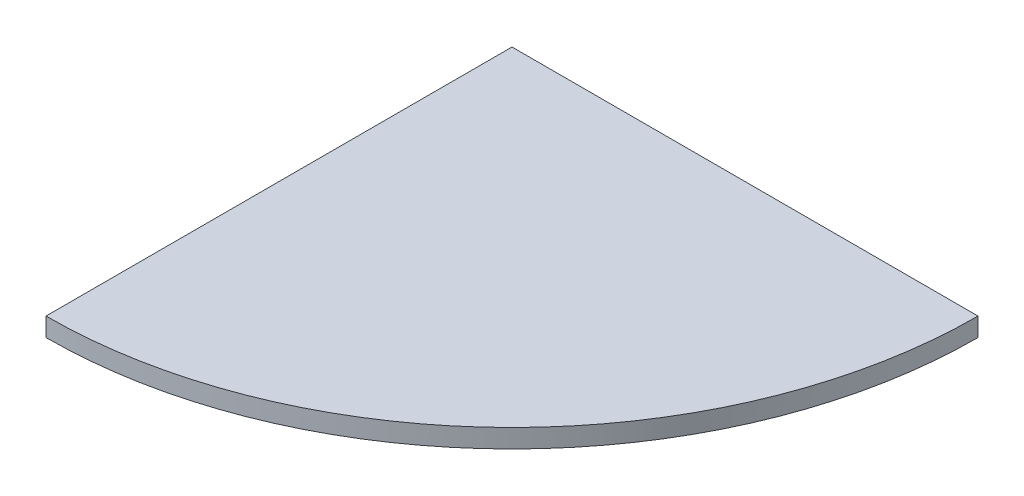
ISO-10303-21;
HEADER;
FILE_DESCRIPTION(('STEP AP214'),'2;1');
FILE_NAME('part.step','',(''),(''),'','','');
FILE_SCHEMA(('AUTOMOTIVE_DESIGN { 1 0 10303 214 1 1 1 1 }'));
ENDSEC;
DATA;
#1=APPLICATION_CONTEXT('core data for automotive mechanical design processes');
#2=APPLICATION_PROTOCOL_DEFINITION('international standard','automotive_design',2000,#1);
#3=PRODUCT_CONTEXT('',#1,'mechanical');
#4=PRODUCT('Part','Part','',(#3));
#5=PRODUCT_RELATED_PRODUCT_CATEGORY('part','',(#4));
#6=PRODUCT_DEFINITION_FORMATION('','',#4);
#7=PRODUCT_DEFINITION_CONTEXT('part definition',#1,'design');
#8=PRODUCT_DEFINITION('design','',#6,#7);
#9=PRODUCT_DEFINITION_SHAPE('','',#8);
#10=(LENGTH_UNIT() NAMED_UNIT(*) SI_UNIT(.MILLI.,.METRE.));
#11=(NAMED_UNIT(*) PLANE_ANGLE_UNIT() SI_UNIT($,.RADIAN.));
#12=(NAMED_UNIT(*) SI_UNIT($,.STERADIAN.) SOLID_ANGLE_UNIT());
#13=UNCERTAINTY_MEASURE_WITH_UNIT(LENGTH_MEASURE(1.E-05),#10,'distance_accuracy_value','');
#14=(GEOMETRIC_REPRESENTATION_CONTEXT(3) GLOBAL_UNCERTAINTY_ASSIGNED_CONTEXT((#13)) GLOBAL_UNIT_ASSIGNED_CONTEXT((#10,
#11,#12)) REPRESENTATION_CONTEXT('',''));
#15=CARTESIAN_POINT('',(0.,0.,0.));
#16=DIRECTION('',(0.,0.,1.));
#17=DIRECTION('',(1.,0.,0.));
#18=AXIS2_PLACEMENT_3D('',#15,#16,#17);
#19=CARTESIAN_POINT('',(0.,18.,450.));
#20=DIRECTION('',(1.,0.,0.));
#21=DIRECTION('',(0.,0.,-1.));
#22=AXIS2_PLACEMENT_3D('',#19,#20,#21);
#23=PLANE('',#22);
#24=DIRECTION('',(0.,0.,1.));
#25=VECTOR('',#24,1.);
#26=CARTESIAN_POINT('',(0.,0.,450.));
#27=LINE('',#26,#25);
#28=CARTESIAN_POINT('',(0.,0.,0.));
#29=VERTEX_POINT('',#28);
#30=CARTESIAN_POINT('',(0.,0.,450.));
#31=VERTEX_POINT('',#30);
#32=EDGE_CURVE('E80',#29,#31,#27,.T.);
#33=ORIENTED_EDGE('',*,*,#32,.T.);
#34=DIRECTION('',(0.,-1.,0.));
#35=VECTOR('',#34,1.);
#36=CARTESIAN_POINT('',(0.,18.,450.));
#37=LINE('',#36,#35);
#38=CARTESIAN_POINT('',(0.,18.,450.));
#39=VERTEX_POINT('',#38);
#40=EDGE_CURVE('E11',#39,#31,#37,.T.);
#41=ORIENTED_EDGE('',*,*,#40,.F.);
#42=DIRECTION('',(0.,0.,1.));
#43=VECTOR('',#42,1.);
#44=CARTESIAN_POINT('',(0.,18.,450.));
#45=LINE('',#44,#43);
#46=CARTESIAN_POINT('',(0.,18.,0.));
#47=VERTEX_POINT('',#46);
#48=EDGE_CURVE('E73',#47,#39,#45,.T.);
#49=ORIENTED_EDGE('',*,*,#48,.F.);
#50=DIRECTION('',(0.,-1.,0.));
#51=VECTOR('',#50,1.);
#52=CARTESIAN_POINT('',(0.,18.,0.));
#53=LINE('',#52,#51);
#54=EDGE_CURVE('E81',#47,#29,#53,.T.);
#55=ORIENTED_EDGE('',*,*,#54,.T.);
#56=EDGE_LOOP('',(#33,#41,#49,#55));
#57=FACE_BOUND('',#56,.T.);
#58=ADVANCED_FACE('F33',(#57),#23,.F.);
#59=CARTESIAN_POINT('',(0.,18.,0.));
#60=DIRECTION('',(0.,-1.,0.));
#61=DIRECTION('',(0.,0.,-1.));
#62=AXIS2_PLACEMENT_3D('',#59,#60,#61);
#63=CYLINDRICAL_SURFACE('',#62,450.);
#64=CARTESIAN_POINT('',(0.,0.,0.));
#65=DIRECTION('',(0.,1.,0.));
#66=DIRECTION('',(0.,0.,-1.));
#67=AXIS2_PLACEMENT_3D('',#64,#65,#66);
#68=CIRCLE('',#67,450.);
#69=CARTESIAN_POINT('',(450.,0.,0.));
#70=VERTEX_POINT('',#69);
#71=EDGE_CURVE('E61',#31,#70,#68,.T.);
#72=ORIENTED_EDGE('',*,*,#71,.T.);
#73=DIRECTION('',(0.,-1.,0.));
#74=VECTOR('',#73,1.);
#75=CARTESIAN_POINT('',(450.,18.,0.));
#76=LINE('',#75,#74);
#77=CARTESIAN_POINT('',(450.,18.,0.));
#78=VERTEX_POINT('',#77);
#79=EDGE_CURVE('E41',#78,#70,#76,.T.);
#80=ORIENTED_EDGE('',*,*,#79,.F.);
#81=CARTESIAN_POINT('',(0.,18.,0.));
#82=DIRECTION('',(0.,1.,0.));
#83=DIRECTION('',(0.,0.,-1.));
#84=AXIS2_PLACEMENT_3D('',#81,#82,#83);
#85=CIRCLE('',#84,450.);
#86=EDGE_CURVE('E69',#39,#78,#85,.T.);
#87=ORIENTED_EDGE('',*,*,#86,.F.);
#88=ORIENTED_EDGE('',*,*,#40,.T.);
#89=EDGE_LOOP('',(#72,#80,#87,#88));
#90=FACE_BOUND('',#89,.T.);
#91=ADVANCED_FACE('F70',(#90),#63,.T.);
#92=CARTESIAN_POINT('',(0.,18.,0.));
#93=DIRECTION('',(0.,0.,1.));
#94=DIRECTION('',(1.,0.,0.));
#95=AXIS2_PLACEMENT_3D('',#92,#93,#94);
#96=PLANE('',#95);
#97=DIRECTION('',(-1.,0.,0.));
#98=VECTOR('',#97,1.);
#99=CARTESIAN_POINT('',(0.,0.,0.));
#100=LINE('',#99,#98);
#101=EDGE_CURVE('E66',#70,#29,#100,.T.);
#102=ORIENTED_EDGE('',*,*,#101,.T.);
#103=ORIENTED_EDGE('',*,*,#54,.F.);
#104=DIRECTION('',(-1.,0.,0.));
#105=VECTOR('',#104,1.);
#106=CARTESIAN_POINT('',(0.,18.,0.));
#107=LINE('',#106,#105);
#108=EDGE_CURVE('E49',#78,#47,#107,.T.);
#109=ORIENTED_EDGE('',*,*,#108,.F.);
#110=ORIENTED_EDGE('',*,*,#79,.T.);
#111=EDGE_LOOP('',(#102,#103,#109,#110));
#112=FACE_BOUND('',#111,.T.);
#113=ADVANCED_FACE('F88',(#112),#96,.F.);
#114=CARTESIAN_POINT('',(0.,18.,0.));
#115=DIRECTION('',(0.,-1.,0.));
#116=DIRECTION('',(0.,0.,-1.));
#117=AXIS2_PLACEMENT_3D('',#114,#115,#116);
#118=PLANE('',#117);
#119=ORIENTED_EDGE('',*,*,#48,.T.);
#120=ORIENTED_EDGE('',*,*,#86,.T.);
#121=ORIENTED_EDGE('',*,*,#108,.T.);
#122=EDGE_LOOP('',(#119,#120,#121));
#123=FACE_BOUND('',#122,.T.);
#124=ADVANCED_FACE('F76',(#123),#118,.F.);
#125=CARTESIAN_POINT('',(0.,0.,0.));
#126=DIRECTION('',(0.,-1.,0.));
#127=DIRECTION('',(0.,0.,-1.));
#128=AXIS2_PLACEMENT_3D('',#125,#126,#127);
#129=PLANE('',#128);
#130=ORIENTED_EDGE('',*,*,#32,.F.);
#131=ORIENTED_EDGE('',*,*,#101,.F.);
#132=ORIENTED_EDGE('',*,*,#71,.F.);
#133=EDGE_LOOP('',(#130,#131,#132));
#134=FACE_BOUND('',#133,.T.);
#135=ADVANCED_FACE('F89',(#134),#129,.T.);
#136=CLOSED_SHELL('',(#58,#91,#113,#124,#135));
#137=MANIFOLD_SOLID_BREP('B2',#136);
#138=ADVANCED_BREP_SHAPE_REPRESENTATION('',(#18,#137),#14);
#139=SHAPE_DEFINITION_REPRESENTATION(#9,#138);
ENDSEC;
END-ISO-10303-21;
